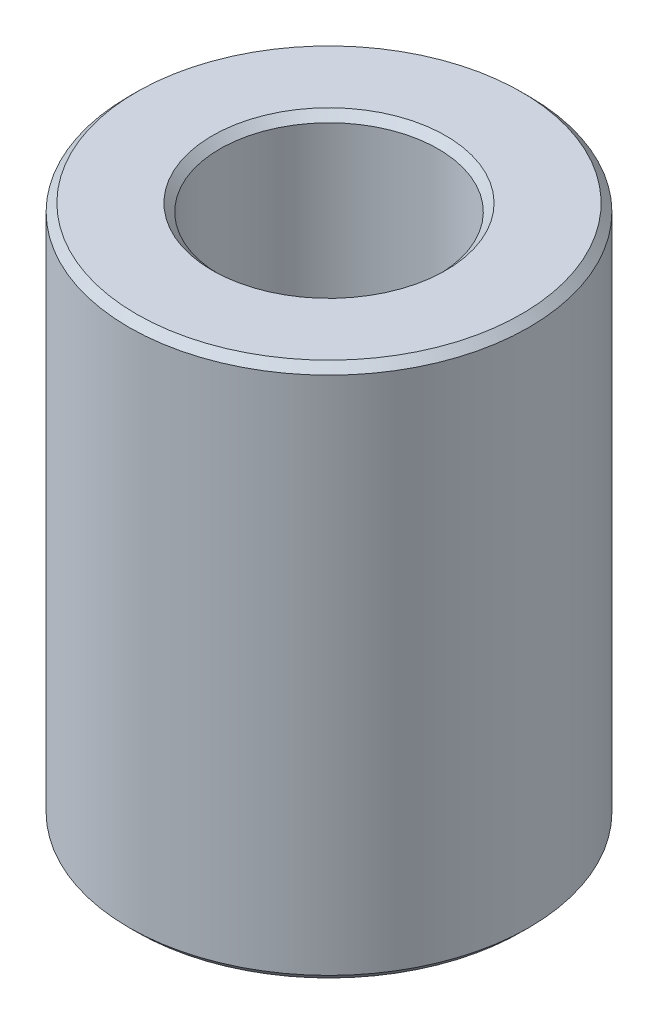
ISO-10303-21;
HEADER;
FILE_DESCRIPTION(('STEP AP214'),'2;1');
FILE_NAME('part.step','',(''),(''),'','','');
FILE_SCHEMA(('AUTOMOTIVE_DESIGN { 1 0 10303 214 1 1 1 1 }'));
ENDSEC;
DATA;
#1=APPLICATION_CONTEXT('core data for automotive mechanical design processes');
#2=APPLICATION_PROTOCOL_DEFINITION('international standard','automotive_design',2000,#1);
#3=PRODUCT_CONTEXT('',#1,'mechanical');
#4=PRODUCT('Part','Part','',(#3));
#5=PRODUCT_RELATED_PRODUCT_CATEGORY('part','',(#4));
#6=PRODUCT_DEFINITION_FORMATION('','',#4);
#7=PRODUCT_DEFINITION_CONTEXT('part definition',#1,'design');
#8=PRODUCT_DEFINITION('design','',#6,#7);
#9=PRODUCT_DEFINITION_SHAPE('','',#8);
#10=(LENGTH_UNIT() NAMED_UNIT(*) SI_UNIT(.MILLI.,.METRE.));
#11=(NAMED_UNIT(*) PLANE_ANGLE_UNIT() SI_UNIT($,.RADIAN.));
#12=(NAMED_UNIT(*) SI_UNIT($,.STERADIAN.) SOLID_ANGLE_UNIT());
#13=UNCERTAINTY_MEASURE_WITH_UNIT(LENGTH_MEASURE(1.E-05),#10,'distance_accuracy_value','');
#14=(GEOMETRIC_REPRESENTATION_CONTEXT(3) GLOBAL_UNCERTAINTY_ASSIGNED_CONTEXT((#13)) GLOBAL_UNIT_ASSIGNED_CONTEXT((#10,
#11,#12)) REPRESENTATION_CONTEXT('',''));
#15=CARTESIAN_POINT('',(0.,0.,0.));
#16=DIRECTION('',(0.,0.,1.));
#17=DIRECTION('',(1.,0.,0.));
#18=AXIS2_PLACEMENT_3D('',#15,#16,#17);
#19=CARTESIAN_POINT('',(0.,40.1194777970229,0.));
#20=DIRECTION('',(0.,-1.,0.));
#21=DIRECTION('',(0.,0.,-1.));
#22=AXIS2_PLACEMENT_3D('',#19,#20,#21);
#23=CYLINDRICAL_SURFACE('',#22,15.);
#24=CARTESIAN_POINT('',(0.,0.57074371591765,0.));
#25=DIRECTION('',(0.,1.,0.));
#26=DIRECTION('',(0.,0.,1.));
#27=AXIS2_PLACEMENT_3D('',#24,#25,#26);
#28=CIRCLE('',#27,15.);
#29=CARTESIAN_POINT('',(0.,0.57074371591765,15.));
#30=VERTEX_POINT('',#29);
#31=EDGE_CURVE('E10',#30,#30,#28,.T.);
#32=ORIENTED_EDGE('',*,*,#31,.T.);
#33=EDGE_LOOP('',(#32));
#34=FACE_BOUND('',#33,.T.);
#35=CARTESIAN_POINT('',(0.,39.5487340811053,0.));
#36=DIRECTION('',(0.,1.,0.));
#37=DIRECTION('',(0.,0.,1.));
#38=AXIS2_PLACEMENT_3D('',#35,#36,#37);
#39=CIRCLE('',#38,15.);
#40=CARTESIAN_POINT('',(0.,39.5487340811053,15.));
#41=VERTEX_POINT('',#40);
#42=EDGE_CURVE('E50',#41,#41,#39,.F.);
#43=ORIENTED_EDGE('',*,*,#42,.T.);
#44=EDGE_LOOP('',(#43));
#45=FACE_BOUND('',#44,.T.);
#46=ADVANCED_FACE('F39',(#34,#45),#23,.T.);
#47=CARTESIAN_POINT('',(0.,40.1194777970229,0.));
#48=DIRECTION('',(0.,1.,0.));
#49=DIRECTION('',(0.,0.,1.));
#50=AXIS2_PLACEMENT_3D('',#47,#48,#49);
#51=PLANE('',#50);
#52=CARTESIAN_POINT('',(0.,40.1194777970229,0.));
#53=DIRECTION('',(0.,1.,0.));
#54=DIRECTION('',(0.,0.,1.));
#55=AXIS2_PLACEMENT_3D('',#52,#53,#54);
#56=CIRCLE('',#55,8.75358669921022);
#57=CARTESIAN_POINT('',(0.,40.1194777970229,8.75358669921022));
#58=VERTEX_POINT('',#57);
#59=EDGE_CURVE('E58',#58,#58,#56,.F.);
#60=ORIENTED_EDGE('',*,*,#59,.T.);
#61=EDGE_LOOP('',(#60));
#62=FACE_BOUND('',#61,.T.);
#63=CARTESIAN_POINT('',(0.,40.1194777970229,0.));
#64=DIRECTION('',(0.,1.,0.));
#65=DIRECTION('',(0.,0.,1.));
#66=AXIS2_PLACEMENT_3D('',#63,#64,#65);
#67=CIRCLE('',#66,14.4292562840824);
#68=CARTESIAN_POINT('',(0.,40.1194777970229,14.4292562840824));
#69=VERTEX_POINT('',#68);
#70=EDGE_CURVE('E61',#69,#69,#67,.T.);
#71=ORIENTED_EDGE('',*,*,#70,.T.);
#72=EDGE_LOOP('',(#71));
#73=FACE_BOUND('',#72,.T.);
#74=ADVANCED_FACE('F88',(#62,#73),#51,.T.);
#75=CARTESIAN_POINT('',(0.,0.,0.));
#76=DIRECTION('',(0.,1.,0.));
#77=DIRECTION('',(0.,0.,1.));
#78=AXIS2_PLACEMENT_3D('',#75,#76,#77);
#79=PLANE('',#78);
#80=CARTESIAN_POINT('',(0.,0.,0.));
#81=DIRECTION('',(0.,1.,0.));
#82=DIRECTION('',(0.,0.,1.));
#83=AXIS2_PLACEMENT_3D('',#80,#81,#82);
#84=CIRCLE('',#83,8.7535866992102);
#85=CARTESIAN_POINT('',(0.,0.,8.7535866992102));
#86=VERTEX_POINT('',#85);
#87=EDGE_CURVE('E51',#86,#86,#84,.T.);
#88=ORIENTED_EDGE('',*,*,#87,.T.);
#89=EDGE_LOOP('',(#88));
#90=FACE_BOUND('',#89,.T.);
#91=CARTESIAN_POINT('',(0.,0.,0.));
#92=DIRECTION('',(0.,1.,0.));
#93=DIRECTION('',(0.,0.,1.));
#94=AXIS2_PLACEMENT_3D('',#91,#92,#93);
#95=CIRCLE('',#94,14.4292562840823);
#96=CARTESIAN_POINT('',(0.,0.,14.4292562840823));
#97=VERTEX_POINT('',#96);
#98=EDGE_CURVE('E54',#97,#97,#95,.F.);
#99=ORIENTED_EDGE('',*,*,#98,.T.);
#100=EDGE_LOOP('',(#99));
#101=FACE_BOUND('',#100,.T.);
#102=ADVANCED_FACE('F83',(#90,#101),#79,.F.);
#103=CARTESIAN_POINT('',(0.,40.1194777970229,0.));
#104=DIRECTION('',(0.,-1.,0.));
#105=DIRECTION('',(0.,0.,-1.));
#106=AXIS2_PLACEMENT_3D('',#103,#104,#105);
#107=CYLINDRICAL_SURFACE('',#106,8.18284298329256);
#108=CARTESIAN_POINT('',(0.,39.5487340811053,0.));
#109=DIRECTION('',(0.,1.,0.));
#110=DIRECTION('',(0.,0.,1.));
#111=AXIS2_PLACEMENT_3D('',#108,#109,#110);
#112=CIRCLE('',#111,8.18284298329256);
#113=CARTESIAN_POINT('',(0.,39.5487340811053,8.18284298329256));
#114=VERTEX_POINT('',#113);
#115=EDGE_CURVE('E67',#114,#114,#112,.T.);
#116=ORIENTED_EDGE('',*,*,#115,.T.);
#117=EDGE_LOOP('',(#116));
#118=FACE_BOUND('',#117,.T.);
#119=CARTESIAN_POINT('',(0.,0.57074371591765,0.));
#120=DIRECTION('',(0.,1.,0.));
#121=DIRECTION('',(0.,0.,1.));
#122=AXIS2_PLACEMENT_3D('',#119,#120,#121);
#123=CIRCLE('',#122,8.18284298329256);
#124=CARTESIAN_POINT('',(0.,0.57074371591765,8.18284298329256));
#125=VERTEX_POINT('',#124);
#126=EDGE_CURVE('E69',#125,#125,#123,.F.);
#127=ORIENTED_EDGE('',*,*,#126,.T.);
#128=EDGE_LOOP('',(#127));
#129=FACE_BOUND('',#128,.T.);
#130=ADVANCED_FACE('F71',(#118,#129),#107,.F.);
#131=CARTESIAN_POINT('',(0.,39.5487340811053,0.));
#132=DIRECTION('',(0.,1.,0.));
#133=DIRECTION('',(0.,0.,1.));
#134=AXIS2_PLACEMENT_3D('',#131,#132,#133);
#135=CONICAL_SURFACE('',#134,8.18284298329256,0.78539816339745);
#136=ORIENTED_EDGE('',*,*,#59,.F.);
#137=EDGE_LOOP('',(#136));
#138=FACE_BOUND('',#137,.T.);
#139=ORIENTED_EDGE('',*,*,#115,.F.);
#140=EDGE_LOOP('',(#139));
#141=FACE_BOUND('',#140,.T.);
#142=ADVANCED_FACE('F77',(#138,#141),#135,.F.);
#143=CARTESIAN_POINT('',(0.,0.,0.));
#144=DIRECTION('',(0.,-1.,0.));
#145=DIRECTION('',(0.,0.,-1.));
#146=AXIS2_PLACEMENT_3D('',#143,#144,#145);
#147=CONICAL_SURFACE('',#146,8.7535866992102,0.785398163397444);
#148=ORIENTED_EDGE('',*,*,#126,.F.);
#149=EDGE_LOOP('',(#148));
#150=FACE_BOUND('',#149,.T.);
#151=ORIENTED_EDGE('',*,*,#87,.F.);
#152=EDGE_LOOP('',(#151));
#153=FACE_BOUND('',#152,.T.);
#154=ADVANCED_FACE('F73',(#150,#153),#147,.F.);
#155=CARTESIAN_POINT('',(0.,0.57074371591765,0.));
#156=DIRECTION('',(0.,1.,0.));
#157=DIRECTION('',(0.,0.,1.));
#158=AXIS2_PLACEMENT_3D('',#155,#156,#157);
#159=CONICAL_SURFACE('',#158,15.,0.785398163397451);
#160=ORIENTED_EDGE('',*,*,#98,.F.);
#161=EDGE_LOOP('',(#160));
#162=FACE_BOUND('',#161,.T.);
#163=ORIENTED_EDGE('',*,*,#31,.F.);
#164=EDGE_LOOP('',(#163));
#165=FACE_BOUND('',#164,.T.);
#166=ADVANCED_FACE('F76',(#162,#165),#159,.T.);
#167=CARTESIAN_POINT('',(0.,40.1194777970229,0.));
#168=DIRECTION('',(0.,-1.,0.));
#169=DIRECTION('',(0.,0.,-1.));
#170=AXIS2_PLACEMENT_3D('',#167,#168,#169);
#171=CONICAL_SURFACE('',#170,14.4292562840824,0.785398163397442);
#172=ORIENTED_EDGE('',*,*,#42,.F.);
#173=EDGE_LOOP('',(#172));
#174=FACE_BOUND('',#173,.T.);
#175=ORIENTED_EDGE('',*,*,#70,.F.);
#176=EDGE_LOOP('',(#175));
#177=FACE_BOUND('',#176,.T.);
#178=ADVANCED_FACE('F45',(#174,#177),#171,.T.);
#179=CLOSED_SHELL('',(#46,#74,#102,#130,#142,#154,#166,#178));
#180=MANIFOLD_SOLID_BREP('B2',#179);
#181=ADVANCED_BREP_SHAPE_REPRESENTATION('',(#18,#180),#14);
#182=SHAPE_DEFINITION_REPRESENTATION(#9,#181);
ENDSEC;
END-ISO-10303-21;
